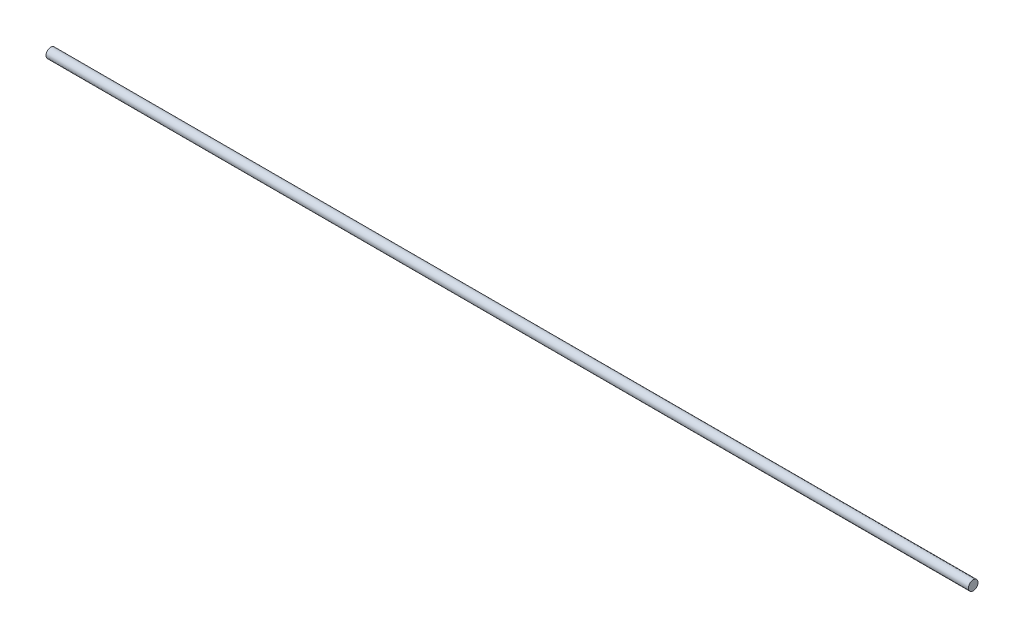
ISO-10303-21;
HEADER;
FILE_DESCRIPTION(('STEP AP214'),'2;1');
FILE_NAME('part.step','',(''),(''),'','','');
FILE_SCHEMA(('AUTOMOTIVE_DESIGN { 1 0 10303 214 1 1 1 1 }'));
ENDSEC;
DATA;
#1=APPLICATION_CONTEXT('core data for automotive mechanical design processes');
#2=APPLICATION_PROTOCOL_DEFINITION('international standard','automotive_design',2000,#1);
#3=PRODUCT_CONTEXT('',#1,'mechanical');
#4=PRODUCT('Part','Part','',(#3));
#5=PRODUCT_RELATED_PRODUCT_CATEGORY('part','',(#4));
#6=PRODUCT_DEFINITION_FORMATION('','',#4);
#7=PRODUCT_DEFINITION_CONTEXT('part definition',#1,'design');
#8=PRODUCT_DEFINITION('design','',#6,#7);
#9=PRODUCT_DEFINITION_SHAPE('','',#8);
#10=(LENGTH_UNIT() NAMED_UNIT(*) SI_UNIT(.MILLI.,.METRE.));
#11=(NAMED_UNIT(*) PLANE_ANGLE_UNIT() SI_UNIT($,.RADIAN.));
#12=(NAMED_UNIT(*) SI_UNIT($,.STERADIAN.) SOLID_ANGLE_UNIT());
#13=UNCERTAINTY_MEASURE_WITH_UNIT(LENGTH_MEASURE(1.E-05),#10,'distance_accuracy_value','');
#14=(GEOMETRIC_REPRESENTATION_CONTEXT(3) GLOBAL_UNCERTAINTY_ASSIGNED_CONTEXT((#13)) GLOBAL_UNIT_ASSIGNED_CONTEXT((#10,
#11,#12)) REPRESENTATION_CONTEXT('',''));
#15=CARTESIAN_POINT('',(0.,0.,0.));
#16=DIRECTION('',(0.,0.,1.));
#17=DIRECTION('',(1.,0.,0.));
#18=AXIS2_PLACEMENT_3D('',#15,#16,#17);
#19=CARTESIAN_POINT('',(1828.8,0.,0.));
#20=DIRECTION('',(-1.,0.,0.));
#21=DIRECTION('',(0.,0.,1.));
#22=AXIS2_PLACEMENT_3D('',#19,#20,#21);
#23=CYLINDRICAL_SURFACE('',#22,9.525);
#24=CARTESIAN_POINT('',(1828.8,0.,0.));
#25=DIRECTION('',(1.,0.,0.));
#26=DIRECTION('',(0.,0.,-1.));
#27=AXIS2_PLACEMENT_3D('',#24,#25,#26);
#28=CIRCLE('',#27,9.525);
#29=CARTESIAN_POINT('',(1828.8,0.,-9.525));
#30=VERTEX_POINT('',#29);
#31=EDGE_CURVE('E12',#30,#30,#28,.T.);
#32=ORIENTED_EDGE('',*,*,#31,.F.);
#33=EDGE_LOOP('',(#32));
#34=FACE_BOUND('',#33,.T.);
#35=CARTESIAN_POINT('',(0.,0.,0.));
#36=DIRECTION('',(1.,0.,0.));
#37=DIRECTION('',(0.,0.,-1.));
#38=AXIS2_PLACEMENT_3D('',#35,#36,#37);
#39=CIRCLE('',#38,9.525);
#40=CARTESIAN_POINT('',(0.,0.,-9.525));
#41=VERTEX_POINT('',#40);
#42=EDGE_CURVE('E45',#41,#41,#39,.T.);
#43=ORIENTED_EDGE('',*,*,#42,.T.);
#44=EDGE_LOOP('',(#43));
#45=FACE_BOUND('',#44,.T.);
#46=ADVANCED_FACE('F42',(#34,#45),#23,.T.);
#47=CARTESIAN_POINT('',(1828.8,0.,0.));
#48=DIRECTION('',(1.,0.,0.));
#49=DIRECTION('',(0.,0.,-1.));
#50=AXIS2_PLACEMENT_3D('',#47,#48,#49);
#51=PLANE('',#50);
#52=ORIENTED_EDGE('',*,*,#31,.T.);
#53=EDGE_LOOP('',(#52));
#54=FACE_BOUND('',#53,.T.);
#55=ADVANCED_FACE('F57',(#54),#51,.T.);
#56=CARTESIAN_POINT('',(0.,0.,0.));
#57=DIRECTION('',(1.,0.,0.));
#58=DIRECTION('',(0.,0.,-1.));
#59=AXIS2_PLACEMENT_3D('',#56,#57,#58);
#60=PLANE('',#59);
#61=ORIENTED_EDGE('',*,*,#42,.F.);
#62=EDGE_LOOP('',(#61));
#63=FACE_BOUND('',#62,.T.);
#64=ADVANCED_FACE('F55',(#63),#60,.F.);
#65=CLOSED_SHELL('',(#46,#55,#64));
#66=MANIFOLD_SOLID_BREP('B2',#65);
#67=ADVANCED_BREP_SHAPE_REPRESENTATION('',(#18,#66),#14);
#68=SHAPE_DEFINITION_REPRESENTATION(#9,#67);
ENDSEC;
END-ISO-10303-21;
